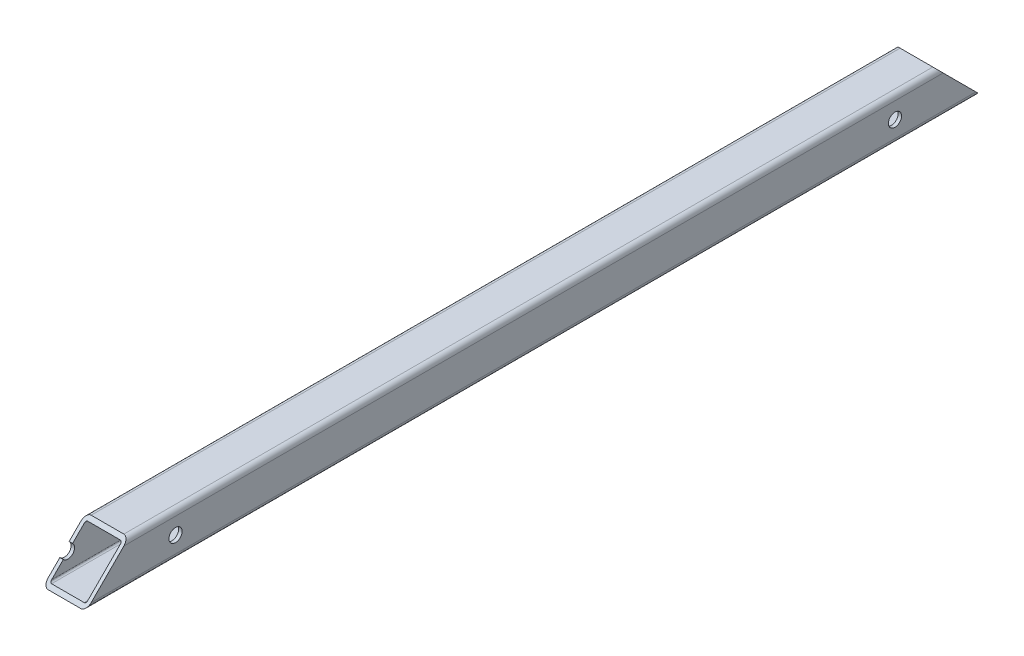
ISO-10303-21;
HEADER;
FILE_DESCRIPTION(('STEP AP214'),'2;1');
FILE_NAME('part.step','',(''),(''),'','','');
FILE_SCHEMA(('AUTOMOTIVE_DESIGN { 1 0 10303 214 1 1 1 1 }'));
ENDSEC;
DATA;
#1=APPLICATION_CONTEXT('core data for automotive mechanical design processes');
#2=APPLICATION_PROTOCOL_DEFINITION('international standard','automotive_design',2000,#1);
#3=PRODUCT_CONTEXT('',#1,'mechanical');
#4=PRODUCT('Part','Part','',(#3));
#5=PRODUCT_RELATED_PRODUCT_CATEGORY('part','',(#4));
#6=PRODUCT_DEFINITION_FORMATION('','',#4);
#7=PRODUCT_DEFINITION_CONTEXT('part definition',#1,'design');
#8=PRODUCT_DEFINITION('design','',#6,#7);
#9=PRODUCT_DEFINITION_SHAPE('','',#8);
#10=(LENGTH_UNIT() NAMED_UNIT(*) SI_UNIT(.MILLI.,.METRE.));
#11=(NAMED_UNIT(*) PLANE_ANGLE_UNIT() SI_UNIT($,.RADIAN.));
#12=(NAMED_UNIT(*) SI_UNIT($,.STERADIAN.) SOLID_ANGLE_UNIT());
#13=UNCERTAINTY_MEASURE_WITH_UNIT(LENGTH_MEASURE(1.E-05),#10,'distance_accuracy_value','');
#14=(GEOMETRIC_REPRESENTATION_CONTEXT(3) GLOBAL_UNCERTAINTY_ASSIGNED_CONTEXT((#13)) GLOBAL_UNIT_ASSIGNED_CONTEXT((#10,
#11,#12)) REPRESENTATION_CONTEXT('',''));
#15=CARTESIAN_POINT('',(0.,0.,0.));
#16=DIRECTION('',(0.,0.,1.));
#17=DIRECTION('',(1.,0.,0.));
#18=AXIS2_PLACEMENT_3D('',#15,#16,#17);
#19=CARTESIAN_POINT('',(-9.50000000001179,-9.49999999999326,-7.56017470848747E-11));
#20=DIRECTION('',(0.,0.,1.));
#21=DIRECTION('',(1.,0.,0.));
#22=AXIS2_PLACEMENT_3D('',#19,#20,#21);
#23=CYLINDRICAL_SURFACE('',#22,3.);
#24=CARTESIAN_POINT('',(-9.50000000001179,-9.49999999999326,-9.50000000007563));
#25=DIRECTION('',(0.,-0.707106781186548,0.707106781186547));
#26=DIRECTION('',(0.,0.707106781186547,0.707106781186548));
#27=AXIS2_PLACEMENT_3D('',#24,#25,#26);
#28=ELLIPSE('',#27,4.24264068711929,3.);
#29=CARTESIAN_POINT('',(-12.5000000000118,-9.49999999999331,-9.50000000007563));
#30=VERTEX_POINT('',#29);
#31=CARTESIAN_POINT('',(-9.50000000001179,-12.4999999999933,-12.5000001000755));
#32=VERTEX_POINT('',#31);
#33=EDGE_CURVE('E394',#30,#32,#28,.T.);
#34=ORIENTED_EDGE('',*,*,#33,.T.);
#35=DIRECTION('',(0.,0.,1.));
#36=VECTOR('',#35,1.);
#37=CARTESIAN_POINT('',(-9.50000000001179,-12.4999999999933,-7.56017470848747E-11));
#38=LINE('',#37,#36);
#39=CARTESIAN_POINT('',(-9.50000000001179,-12.4999999999933,507.500000099924));
#40=VERTEX_POINT('',#39);
#41=EDGE_CURVE('E11',#32,#40,#38,.T.);
#42=ORIENTED_EDGE('',*,*,#41,.T.);
#43=CARTESIAN_POINT('',(-9.50000000001179,-9.49999999999326,504.499999999925));
#44=DIRECTION('',(0.,-0.707106781186548,-0.707106781186547));
#45=DIRECTION('',(0.,0.707106781186547,-0.707106781186548));
#46=AXIS2_PLACEMENT_3D('',#43,#44,#45);
#47=ELLIPSE('',#46,4.24264068711929,3.);
#48=CARTESIAN_POINT('',(-12.5000000000118,-9.49999999999331,504.499999999925));
#49=VERTEX_POINT('',#48);
#50=EDGE_CURVE('E358',#40,#49,#47,.T.);
#51=ORIENTED_EDGE('',*,*,#50,.T.);
#52=DIRECTION('',(0.,0.,-1.));
#53=VECTOR('',#52,1.);
#54=CARTESIAN_POINT('',(-12.5000000000118,-9.49999999999331,-7.56017470848747E-11));
#55=LINE('',#54,#53);
#56=EDGE_CURVE('E295',#49,#30,#55,.T.);
#57=ORIENTED_EDGE('',*,*,#56,.T.);
#58=EDGE_LOOP('',(#34,#42,#51,#57));
#59=FACE_BOUND('',#58,.T.);
#60=ADVANCED_FACE('F16',(#59),#23,.T.);
#61=CARTESIAN_POINT('',(9.4999999999882,-12.4999999999933,-7.56017470848747E-11));
#62=DIRECTION('',(0.,-1.,0.));
#63=DIRECTION('',(0.,0.,-1.));
#64=AXIS2_PLACEMENT_3D('',#61,#62,#63);
#65=PLANE('',#64);
#66=DIRECTION('',(-1.,0.,0.));
#67=VECTOR('',#66,1.);
#68=CARTESIAN_POINT('',(4.74999999998822,-12.4999999999933,507.500000099924));
#69=LINE('',#68,#67);
#70=CARTESIAN_POINT('',(9.4999999999882,-12.4999999999933,507.500000099924));
#71=VERTEX_POINT('',#70);
#72=EDGE_CURVE('E422',#71,#40,#69,.T.);
#73=ORIENTED_EDGE('',*,*,#72,.T.);
#74=ORIENTED_EDGE('',*,*,#41,.F.);
#75=DIRECTION('',(-1.,0.,0.));
#76=VECTOR('',#75,1.);
#77=CARTESIAN_POINT('',(4.74999999998822,-12.4999999999933,-12.5000001000755));
#78=LINE('',#77,#76);
#79=CARTESIAN_POINT('',(9.4999999999882,-12.4999999999933,-12.5000001000755));
#80=VERTEX_POINT('',#79);
#81=EDGE_CURVE('E396',#80,#32,#78,.T.);
#82=ORIENTED_EDGE('',*,*,#81,.F.);
#83=DIRECTION('',(0.,0.,-1.));
#84=VECTOR('',#83,1.);
#85=CARTESIAN_POINT('',(9.4999999999882,-12.4999999999933,-7.56017470848747E-11));
#86=LINE('',#85,#84);
#87=EDGE_CURVE('E27',#71,#80,#86,.T.);
#88=ORIENTED_EDGE('',*,*,#87,.F.);
#89=EDGE_LOOP('',(#73,#74,#82,#88));
#90=FACE_BOUND('',#89,.T.);
#91=ADVANCED_FACE('F516',(#90),#65,.T.);
#92=CARTESIAN_POINT('',(9.4999999999882,-9.49999999999331,-7.56017470848747E-11));
#93=DIRECTION('',(0.,0.,1.));
#94=DIRECTION('',(0.,1.,0.));
#95=AXIS2_PLACEMENT_3D('',#92,#93,#94);
#96=CYLINDRICAL_SURFACE('',#95,3.);
#97=CARTESIAN_POINT('',(9.4999999999882,-9.49999999999331,-9.50000000007563));
#98=DIRECTION('',(0.,-0.707106781186548,0.707106781186547));
#99=DIRECTION('',(0.,0.707106781186547,0.707106781186548));
#100=AXIS2_PLACEMENT_3D('',#97,#98,#99);
#101=ELLIPSE('',#100,4.24264068711929,3.);
#102=CARTESIAN_POINT('',(12.4999999999882,-9.49999999999324,-9.50000000007563));
#103=VERTEX_POINT('',#102);
#104=EDGE_CURVE('E402',#80,#103,#101,.T.);
#105=ORIENTED_EDGE('',*,*,#104,.T.);
#106=DIRECTION('',(0.,0.,-1.));
#107=VECTOR('',#106,1.);
#108=CARTESIAN_POINT('',(12.4999999999882,-9.49999999999324,-7.56017470848747E-11));
#109=LINE('',#108,#107);
#110=CARTESIAN_POINT('',(12.4999999999882,-9.49999999999324,504.499999999925));
#111=VERTEX_POINT('',#110);
#112=EDGE_CURVE('E290',#111,#103,#109,.T.);
#113=ORIENTED_EDGE('',*,*,#112,.F.);
#114=CARTESIAN_POINT('',(9.49999999998823,-9.49999999999331,504.499999999925));
#115=DIRECTION('',(0.,-0.707106781186548,-0.707106781186547));
#116=DIRECTION('',(0.,0.707106781186547,-0.707106781186548));
#117=AXIS2_PLACEMENT_3D('',#114,#115,#116);
#118=ELLIPSE('',#117,4.24264068711929,3.);
#119=EDGE_CURVE('E444',#111,#71,#118,.T.);
#120=ORIENTED_EDGE('',*,*,#119,.T.);
#121=ORIENTED_EDGE('',*,*,#87,.T.);
#122=EDGE_LOOP('',(#105,#113,#120,#121));
#123=FACE_BOUND('',#122,.T.);
#124=ADVANCED_FACE('F521',(#123),#96,.T.);
#125=CARTESIAN_POINT('',(9.49999999998834,9.50000000000669,-7.56017470848747E-11));
#126=DIRECTION('',(0.,0.,1.));
#127=DIRECTION('',(-1.,0.,0.));
#128=AXIS2_PLACEMENT_3D('',#125,#126,#127);
#129=CYLINDRICAL_SURFACE('',#128,1.);
#130=CARTESIAN_POINT('',(9.49999999998834,9.50000000000669,9.49999999992443));
#131=DIRECTION('',(0.,0.707106781186548,-0.707106781186547));
#132=DIRECTION('',(0.,-0.707106781186547,-0.707106781186548));
#133=AXIS2_PLACEMENT_3D('',#130,#131,#132);
#134=ELLIPSE('',#133,1.4142135623731,1.);
#135=CARTESIAN_POINT('',(9.4999999999882,10.5000000000067,10.4999999999244));
#136=VERTEX_POINT('',#135);
#137=CARTESIAN_POINT('',(10.4999999999884,9.50000000000669,9.49999999992443));
#138=VERTEX_POINT('',#137);
#139=EDGE_CURVE('E254',#136,#138,#134,.T.);
#140=ORIENTED_EDGE('',*,*,#139,.T.);
#141=DIRECTION('',(0.,0.,-1.));
#142=VECTOR('',#141,1.);
#143=CARTESIAN_POINT('',(10.4999999999884,9.50000000000669,-7.56017470848747E-11));
#144=LINE('',#143,#142);
#145=CARTESIAN_POINT('',(10.4999999999884,9.50000000000662,485.499999999924));
#146=VERTEX_POINT('',#145);
#147=EDGE_CURVE('E239',#146,#138,#144,.T.);
#148=ORIENTED_EDGE('',*,*,#147,.F.);
#149=CARTESIAN_POINT('',(9.49999999998834,9.50000000000662,485.499999999924));
#150=DIRECTION('',(0.,0.707106781186548,0.707106781186547));
#151=DIRECTION('',(0.,-0.707106781186547,0.707106781186548));
#152=AXIS2_PLACEMENT_3D('',#149,#150,#151);
#153=ELLIPSE('',#152,1.4142135623731,1.);
#154=CARTESIAN_POINT('',(9.4999999999882,10.5000000000067,484.499999999924));
#155=VERTEX_POINT('',#154);
#156=EDGE_CURVE('E381',#146,#155,#153,.T.);
#157=ORIENTED_EDGE('',*,*,#156,.T.);
#158=DIRECTION('',(0.,0.,-1.));
#159=VECTOR('',#158,1.);
#160=CARTESIAN_POINT('',(9.4999999999882,10.5000000000067,-7.56017470848747E-11));
#161=LINE('',#160,#159);
#162=EDGE_CURVE('E256',#155,#136,#161,.T.);
#163=ORIENTED_EDGE('',*,*,#162,.T.);
#164=EDGE_LOOP('',(#140,#148,#157,#163));
#165=FACE_BOUND('',#164,.T.);
#166=ADVANCED_FACE('F255',(#165),#129,.F.);
#167=CARTESIAN_POINT('',(10.4999999999884,9.50000000000669,-7.56017470848747E-11));
#168=DIRECTION('',(1.,0.,0.));
#169=DIRECTION('',(0.,-1.,0.));
#170=AXIS2_PLACEMENT_3D('',#167,#168,#169);
#171=PLANE('',#170);
#172=DIRECTION('',(0.,-0.707106781186547,-0.707106781186548));
#173=VECTOR('',#172,1.);
#174=CARTESIAN_POINT('',(10.4999999999882,2.37500000000669,2.37499999992437));
#175=LINE('',#174,#173);
#176=CARTESIAN_POINT('',(10.4999999999882,-9.49999999999331,-9.50000000007563));
#177=VERTEX_POINT('',#176);
#178=EDGE_CURVE('E244',#138,#177,#175,.T.);
#179=ORIENTED_EDGE('',*,*,#178,.T.);
#180=DIRECTION('',(0.,0.,-1.));
#181=VECTOR('',#180,1.);
#182=CARTESIAN_POINT('',(10.4999999999882,-9.49999999999331,-7.56017470848747E-11));
#183=LINE('',#182,#181);
#184=CARTESIAN_POINT('',(10.4999999999882,-9.49999999999331,504.499999999925));
#185=VERTEX_POINT('',#184);
#186=EDGE_CURVE('E41',#185,#177,#183,.T.);
#187=ORIENTED_EDGE('',*,*,#186,.F.);
#188=DIRECTION('',(0.,0.707106781186547,-0.707106781186548));
#189=VECTOR('',#188,1.);
#190=CARTESIAN_POINT('',(10.4999999999882,249.875000000007,245.124999999924));
#191=LINE('',#190,#189);
#192=EDGE_CURVE('E247',#185,#146,#191,.T.);
#193=ORIENTED_EDGE('',*,*,#192,.T.);
#194=ORIENTED_EDGE('',*,*,#147,.T.);
#195=EDGE_LOOP('',(#179,#187,#193,#194));
#196=FACE_BOUND('',#195,.T.);
#197=CARTESIAN_POINT('',(10.4999999999883,6.64357457935694E-12,455.499999999959));
#198=DIRECTION('',(1.,0.,0.));
#199=DIRECTION('',(0.,1.,0.));
#200=AXIS2_PLACEMENT_3D('',#197,#198,#199);
#201=CIRCLE('',#200,3.8235);
#202=CARTESIAN_POINT('',(10.4999999999884,-3.82349999999336,455.499999999959));
#203=VERTEX_POINT('',#202);
#204=EDGE_CURVE('E367',#203,#203,#201,.T.);
#205=ORIENTED_EDGE('',*,*,#204,.T.);
#206=EDGE_LOOP('',(#205));
#207=FACE_BOUND('',#206,.T.);
#208=CARTESIAN_POINT('',(10.4999999999883,6.67910171614494E-12,37.4999999999433));
#209=DIRECTION('',(1.,0.,0.));
#210=DIRECTION('',(0.,1.,0.));
#211=AXIS2_PLACEMENT_3D('',#208,#209,#210);
#212=CIRCLE('',#211,3.8235);
#213=CARTESIAN_POINT('',(10.4999999999884,-3.82349999999333,37.4999999999433));
#214=VERTEX_POINT('',#213);
#215=EDGE_CURVE('E439',#214,#214,#212,.T.);
#216=ORIENTED_EDGE('',*,*,#215,.T.);
#217=EDGE_LOOP('',(#216));
#218=FACE_BOUND('',#217,.T.);
#219=ADVANCED_FACE('F241',(#196,#207,#218),#171,.F.);
#220=CARTESIAN_POINT('',(9.4999999999882,-9.49999999999331,-7.56017470848747E-11));
#221=DIRECTION('',(0.,0.,1.));
#222=DIRECTION('',(0.,1.,0.));
#223=AXIS2_PLACEMENT_3D('',#220,#221,#222);
#224=CYLINDRICAL_SURFACE('',#223,1.);
#225=CARTESIAN_POINT('',(9.4999999999882,-9.49999999999331,-9.50000000007563));
#226=DIRECTION('',(0.,0.707106781186548,-0.707106781186547));
#227=DIRECTION('',(0.,0.707106781186547,0.707106781186548));
#228=AXIS2_PLACEMENT_3D('',#225,#226,#227);
#229=ELLIPSE('',#228,1.4142135623731,1.);
#230=CARTESIAN_POINT('',(9.4999999999882,-10.4999999999933,-10.5000000000756));
#231=VERTEX_POINT('',#230);
#232=EDGE_CURVE('E266',#177,#231,#229,.T.);
#233=ORIENTED_EDGE('',*,*,#232,.T.);
#234=DIRECTION('',(0.,0.,-1.));
#235=VECTOR('',#234,1.);
#236=CARTESIAN_POINT('',(9.4999999999882,-10.4999999999933,-7.56017470848747E-11));
#237=LINE('',#236,#235);
#238=CARTESIAN_POINT('',(9.49999999998823,-10.4999999999933,505.499999999924));
#239=VERTEX_POINT('',#238);
#240=EDGE_CURVE('E355',#239,#231,#237,.T.);
#241=ORIENTED_EDGE('',*,*,#240,.F.);
#242=CARTESIAN_POINT('',(9.49999999998823,-9.49999999999331,504.499999999925));
#243=DIRECTION('',(0.,0.707106781186548,0.707106781186547));
#244=DIRECTION('',(0.,0.707106781186547,-0.707106781186548));
#245=AXIS2_PLACEMENT_3D('',#242,#243,#244);
#246=ELLIPSE('',#245,1.4142135623731,1.);
#247=EDGE_CURVE('E447',#239,#185,#246,.T.);
#248=ORIENTED_EDGE('',*,*,#247,.T.);
#249=ORIENTED_EDGE('',*,*,#186,.T.);
#250=EDGE_LOOP('',(#233,#241,#248,#249));
#251=FACE_BOUND('',#250,.T.);
#252=ADVANCED_FACE('F500',(#251),#224,.F.);
#253=CARTESIAN_POINT('',(-9.50000000001179,10.5000000000067,-7.56017470848747E-11));
#254=DIRECTION('',(0.,1.,0.));
#255=DIRECTION('',(1.,0.,0.));
#256=AXIS2_PLACEMENT_3D('',#253,#254,#255);
#257=PLANE('',#256);
#258=DIRECTION('',(1.,0.,0.));
#259=VECTOR('',#258,1.);
#260=CARTESIAN_POINT('',(-4.75000000001181,10.5000000000067,10.4999999999244));
#261=LINE('',#260,#259);
#262=CARTESIAN_POINT('',(-9.50000000001179,10.5000000000067,10.4999999999244));
#263=VERTEX_POINT('',#262);
#264=EDGE_CURVE('E261',#263,#136,#261,.T.);
#265=ORIENTED_EDGE('',*,*,#264,.T.);
#266=ORIENTED_EDGE('',*,*,#162,.F.);
#267=DIRECTION('',(-1.,0.,0.));
#268=VECTOR('',#267,1.);
#269=CARTESIAN_POINT('',(-4.75000000001167,10.5000000000067,484.499999999924));
#270=LINE('',#269,#268);
#271=CARTESIAN_POINT('',(-9.50000000001179,10.5000000000067,484.499999999924));
#272=VERTEX_POINT('',#271);
#273=EDGE_CURVE('E384',#155,#272,#270,.T.);
#274=ORIENTED_EDGE('',*,*,#273,.T.);
#275=DIRECTION('',(0.,0.,-1.));
#276=VECTOR('',#275,1.);
#277=CARTESIAN_POINT('',(-9.50000000001179,10.5000000000067,-7.56017470848747E-11));
#278=LINE('',#277,#276);
#279=EDGE_CURVE('E370',#272,#263,#278,.T.);
#280=ORIENTED_EDGE('',*,*,#279,.T.);
#281=EDGE_LOOP('',(#265,#266,#274,#280));
#282=FACE_BOUND('',#281,.T.);
#283=ADVANCED_FACE('F502',(#282),#257,.F.);
#284=CARTESIAN_POINT('',(-1.16529008664656E-11,247.500000000007,247.499999999924));
#285=DIRECTION('',(0.,-0.707106781186548,-0.707106781186547));
#286=DIRECTION('',(0.,0.707106781186547,-0.707106781186548));
#287=AXIS2_PLACEMENT_3D('',#284,#285,#286);
#288=PLANE('',#287);
#289=DIRECTION('',(-1.,0.,0.));
#290=VECTOR('',#289,1.);
#291=CARTESIAN_POINT('',(-17.5000000009672,-2.70362278143617,497.703622781367));
#292=LINE('',#291,#290);
#293=CARTESIAN_POINT('',(-10.5000000000117,-2.70362278143601,497.703622781367));
#294=VERTEX_POINT('',#293);
#295=CARTESIAN_POINT('',(-12.5000000000117,-2.70362278143613,497.703622781367));
#296=VERTEX_POINT('',#295);
#297=EDGE_CURVE('E284',#294,#296,#292,.T.);
#298=ORIENTED_EDGE('',*,*,#297,.T.);
#299=DIRECTION('',(0.,0.707106781186547,-0.707106781186548));
#300=VECTOR('',#299,1.);
#301=CARTESIAN_POINT('',(-12.5000000000117,245.125000000007,249.874999999924));
#302=LINE('',#301,#300);
#303=EDGE_CURVE('E299',#49,#296,#302,.T.);
#304=ORIENTED_EDGE('',*,*,#303,.F.);
#305=ORIENTED_EDGE('',*,*,#50,.F.);
#306=ORIENTED_EDGE('',*,*,#72,.F.);
#307=ORIENTED_EDGE('',*,*,#119,.F.);
#308=DIRECTION('',(0.,-0.707106781186547,0.707106781186548));
#309=VECTOR('',#308,1.);
#310=CARTESIAN_POINT('',(12.4999999999882,249.875000000007,245.124999999924));
#311=LINE('',#310,#309);
#312=CARTESIAN_POINT('',(12.4999999999883,9.50000000000667,485.499999999924));
#313=VERTEX_POINT('',#312);
#314=EDGE_CURVE('E294',#313,#111,#311,.T.);
#315=ORIENTED_EDGE('',*,*,#314,.F.);
#316=CARTESIAN_POINT('',(9.49999999998834,9.50000000000662,485.499999999924));
#317=DIRECTION('',(0.,-0.707106781186548,-0.707106781186547));
#318=DIRECTION('',(0.,-0.707106781186547,0.707106781186548));
#319=AXIS2_PLACEMENT_3D('',#316,#317,#318);
#320=ELLIPSE('',#319,4.24264068711929,3.);
#321=CARTESIAN_POINT('',(9.4999999999882,12.5000000000067,482.499999999925));
#322=VERTEX_POINT('',#321);
#323=EDGE_CURVE('E302',#322,#313,#320,.T.);
#324=ORIENTED_EDGE('',*,*,#323,.F.);
#325=DIRECTION('',(1.,0.,0.));
#326=VECTOR('',#325,1.);
#327=CARTESIAN_POINT('',(-4.75000000001174,12.5000000000067,482.499999999925));
#328=LINE('',#327,#326);
#329=CARTESIAN_POINT('',(-9.50000000001179,12.5000000000067,482.499999999925));
#330=VERTEX_POINT('',#329);
#331=EDGE_CURVE('E359',#330,#322,#328,.T.);
#332=ORIENTED_EDGE('',*,*,#331,.F.);
#333=CARTESIAN_POINT('',(-9.50000000001165,9.50000000000667,485.499999999924));
#334=DIRECTION('',(0.,-0.707106781186548,-0.707106781186547));
#335=DIRECTION('',(0.,-0.707106781186547,0.707106781186548));
#336=AXIS2_PLACEMENT_3D('',#333,#334,#335);
#337=ELLIPSE('',#336,4.24264068711929,3.);
#338=CARTESIAN_POINT('',(-12.5000000000117,9.50000000000662,485.499999999924));
#339=VERTEX_POINT('',#338);
#340=EDGE_CURVE('E139',#339,#330,#337,.T.);
#341=ORIENTED_EDGE('',*,*,#340,.F.);
#342=DIRECTION('',(0.,0.707106781186547,-0.707106781186548));
#343=VECTOR('',#342,1.);
#344=CARTESIAN_POINT('',(-12.5000000000117,245.125000000007,249.874999999924));
#345=LINE('',#344,#343);
#346=CARTESIAN_POINT('',(-12.5000000000118,2.70362277429731,492.296377225634));
#347=VERTEX_POINT('',#346);
#348=EDGE_CURVE('E330',#347,#339,#345,.T.);
#349=ORIENTED_EDGE('',*,*,#348,.F.);
#350=DIRECTION('',(1.,0.,0.));
#351=VECTOR('',#350,1.);
#352=CARTESIAN_POINT('',(-17.5000000009674,2.70362277429728,492.296377225634));
#353=LINE('',#352,#351);
#354=CARTESIAN_POINT('',(-10.5000000000118,2.70362277429744,492.296377225634));
#355=VERTEX_POINT('',#354);
#356=EDGE_CURVE('E388',#347,#355,#353,.T.);
#357=ORIENTED_EDGE('',*,*,#356,.T.);
#358=DIRECTION('',(0.,-0.707106781186547,0.707106781186548));
#359=VECTOR('',#358,1.);
#360=CARTESIAN_POINT('',(-10.5000000000117,245.125000000007,249.874999999924));
#361=LINE('',#360,#359);
#362=CARTESIAN_POINT('',(-10.5000000000117,9.50000000000667,485.499999999924));
#363=VERTEX_POINT('',#362);
#364=EDGE_CURVE('E313',#363,#355,#361,.T.);
#365=ORIENTED_EDGE('',*,*,#364,.F.);
#366=CARTESIAN_POINT('',(-9.50000000001165,9.50000000000667,485.499999999924));
#367=DIRECTION('',(0.,0.707106781186548,0.707106781186547));
#368=DIRECTION('',(0.,-0.707106781186547,0.707106781186548));
#369=AXIS2_PLACEMENT_3D('',#366,#367,#368);
#370=ELLIPSE('',#369,1.4142135623731,1.);
#371=EDGE_CURVE('E320',#272,#363,#370,.T.);
#372=ORIENTED_EDGE('',*,*,#371,.F.);
#373=ORIENTED_EDGE('',*,*,#273,.F.);
#374=ORIENTED_EDGE('',*,*,#156,.F.);
#375=ORIENTED_EDGE('',*,*,#192,.F.);
#376=ORIENTED_EDGE('',*,*,#247,.F.);
#377=DIRECTION('',(1.,0.,0.));
#378=VECTOR('',#377,1.);
#379=CARTESIAN_POINT('',(4.74999999998833,-10.4999999999934,505.499999999925));
#380=LINE('',#379,#378);
#381=CARTESIAN_POINT('',(-9.50000000001179,-10.4999999999933,505.499999999924));
#382=VERTEX_POINT('',#381);
#383=EDGE_CURVE('E351',#382,#239,#380,.T.);
#384=ORIENTED_EDGE('',*,*,#383,.F.);
#385=CARTESIAN_POINT('',(-9.50000000001179,-9.49999999999326,504.499999999925));
#386=DIRECTION('',(0.,0.707106781186548,0.707106781186547));
#387=DIRECTION('',(0.,0.707106781186547,-0.707106781186548));
#388=AXIS2_PLACEMENT_3D('',#385,#386,#387);
#389=ELLIPSE('',#388,1.4142135623731,1.);
#390=CARTESIAN_POINT('',(-10.5000000000118,-9.49999999999326,504.499999999925));
#391=VERTEX_POINT('',#390);
#392=EDGE_CURVE('E57',#391,#382,#389,.T.);
#393=ORIENTED_EDGE('',*,*,#392,.F.);
#394=DIRECTION('',(0.,-0.707106781186547,0.707106781186548));
#395=VECTOR('',#394,1.);
#396=CARTESIAN_POINT('',(-10.5000000000117,245.125000000007,249.874999999924));
#397=LINE('',#396,#395);
#398=EDGE_CURVE('E312',#294,#391,#397,.T.);
#399=ORIENTED_EDGE('',*,*,#398,.F.);
#400=EDGE_LOOP('',(#298,#304,#305,#306,#307,#315,#324,#332,#341,#349,#357,#365,#372,#373,#374,
#375,#376,#384,#393,#399));
#401=FACE_BOUND('',#400,.T.);
#402=ADVANCED_FACE('F509',(#401),#288,.F.);
#403=CARTESIAN_POINT('',(-9.50000000001165,9.50000000000674,-7.56017470848747E-11));
#404=DIRECTION('',(0.,0.,1.));
#405=DIRECTION('',(0.,-1.,0.));
#406=AXIS2_PLACEMENT_3D('',#403,#404,#405);
#407=CYLINDRICAL_SURFACE('',#406,3.);
#408=CARTESIAN_POINT('',(-9.50000000001165,9.50000000000674,9.49999999992443));
#409=DIRECTION('',(0.,-0.707106781186548,0.707106781186547));
#410=DIRECTION('',(0.,-0.707106781186547,-0.707106781186548));
#411=AXIS2_PLACEMENT_3D('',#408,#409,#410);
#412=ELLIPSE('',#411,4.24264068711929,3.);
#413=CARTESIAN_POINT('',(-9.50000000001179,12.5000000000067,12.4999999999244));
#414=VERTEX_POINT('',#413);
#415=CARTESIAN_POINT('',(-12.5000000000117,9.50000000000667,9.49999999992443));
#416=VERTEX_POINT('',#415);
#417=EDGE_CURVE('E322',#414,#416,#412,.T.);
#418=ORIENTED_EDGE('',*,*,#417,.T.);
#419=DIRECTION('',(0.,0.,-1.));
#420=VECTOR('',#419,1.);
#421=CARTESIAN_POINT('',(-12.5000000000117,9.50000000000667,-7.56017470848747E-11));
#422=LINE('',#421,#420);
#423=EDGE_CURVE('E334',#339,#416,#422,.T.);
#424=ORIENTED_EDGE('',*,*,#423,.F.);
#425=ORIENTED_EDGE('',*,*,#340,.T.);
#426=DIRECTION('',(0.,0.,-1.));
#427=VECTOR('',#426,1.);
#428=CARTESIAN_POINT('',(-9.50000000001179,12.5000000000068,-7.56017470848747E-11));
#429=LINE('',#428,#427);
#430=EDGE_CURVE('E416',#330,#414,#429,.T.);
#431=ORIENTED_EDGE('',*,*,#430,.T.);
#432=EDGE_LOOP('',(#418,#424,#425,#431));
#433=FACE_BOUND('',#432,.T.);
#434=ADVANCED_FACE('F569',(#433),#407,.T.);
#435=CARTESIAN_POINT('',(-9.50000000001179,12.5000000000068,-7.56017470848747E-11));
#436=DIRECTION('',(0.,1.,0.));
#437=DIRECTION('',(1.,0.,0.));
#438=AXIS2_PLACEMENT_3D('',#435,#436,#437);
#439=PLANE('',#438);
#440=DIRECTION('',(-1.,0.,0.));
#441=VECTOR('',#440,1.);
#442=CARTESIAN_POINT('',(-4.75000000001181,12.5000000000068,12.4999999999244));
#443=LINE('',#442,#441);
#444=CARTESIAN_POINT('',(9.4999999999882,12.5000000000067,12.4999999999244));
#445=VERTEX_POINT('',#444);
#446=EDGE_CURVE('E325',#445,#414,#443,.T.);
#447=ORIENTED_EDGE('',*,*,#446,.T.);
#448=ORIENTED_EDGE('',*,*,#430,.F.);
#449=ORIENTED_EDGE('',*,*,#331,.T.);
#450=DIRECTION('',(0.,0.,-1.));
#451=VECTOR('',#450,1.);
#452=CARTESIAN_POINT('',(9.4999999999882,12.5000000000067,-7.56017470848747E-11));
#453=LINE('',#452,#451);
#454=EDGE_CURVE('E293',#322,#445,#453,.T.);
#455=ORIENTED_EDGE('',*,*,#454,.T.);
#456=EDGE_LOOP('',(#447,#448,#449,#455));
#457=FACE_BOUND('',#456,.T.);
#458=ADVANCED_FACE('F536',(#457),#439,.T.);
#459=CARTESIAN_POINT('',(9.49999999998834,9.50000000000669,-7.56017470848747E-11));
#460=DIRECTION('',(0.,0.,1.));
#461=DIRECTION('',(-1.,0.,0.));
#462=AXIS2_PLACEMENT_3D('',#459,#460,#461);
#463=CYLINDRICAL_SURFACE('',#462,3.);
#464=CARTESIAN_POINT('',(9.49999999998834,9.50000000000669,9.49999999992443));
#465=DIRECTION('',(0.,-0.707106781186548,0.707106781186547));
#466=DIRECTION('',(0.,-0.707106781186547,-0.707106781186548));
#467=AXIS2_PLACEMENT_3D('',#464,#465,#466);
#468=ELLIPSE('',#467,4.24264068711929,3.);
#469=CARTESIAN_POINT('',(12.4999999999883,9.50000000000674,9.49999999992443));
#470=VERTEX_POINT('',#469);
#471=EDGE_CURVE('E392',#470,#445,#468,.T.);
#472=ORIENTED_EDGE('',*,*,#471,.T.);
#473=ORIENTED_EDGE('',*,*,#454,.F.);
#474=ORIENTED_EDGE('',*,*,#323,.T.);
#475=DIRECTION('',(0.,0.,-1.));
#476=VECTOR('',#475,1.);
#477=CARTESIAN_POINT('',(12.4999999999883,9.50000000000674,-7.56017470848747E-11));
#478=LINE('',#477,#476);
#479=EDGE_CURVE('E317',#313,#470,#478,.T.);
#480=ORIENTED_EDGE('',*,*,#479,.T.);
#481=EDGE_LOOP('',(#472,#473,#474,#480));
#482=FACE_BOUND('',#481,.T.);
#483=ADVANCED_FACE('F528',(#482),#463,.T.);
#484=CARTESIAN_POINT('',(12.4999999999883,9.50000000000674,-7.56017470848747E-11));
#485=DIRECTION('',(1.,0.,0.));
#486=DIRECTION('',(0.,1.,0.));
#487=AXIS2_PLACEMENT_3D('',#484,#485,#486);
#488=PLANE('',#487);
#489=DIRECTION('',(0.,0.707106781186547,0.707106781186548));
#490=VECTOR('',#489,1.);
#491=CARTESIAN_POINT('',(12.4999999999882,2.37500000000674,2.37499999992437));
#492=LINE('',#491,#490);
#493=EDGE_CURVE('E409',#103,#470,#492,.T.);
#494=ORIENTED_EDGE('',*,*,#493,.T.);
#495=ORIENTED_EDGE('',*,*,#479,.F.);
#496=ORIENTED_EDGE('',*,*,#314,.T.);
#497=ORIENTED_EDGE('',*,*,#112,.T.);
#498=EDGE_LOOP('',(#494,#495,#496,#497));
#499=FACE_BOUND('',#498,.T.);
#500=CARTESIAN_POINT('',(12.4999999999883,6.67910171614494E-12,455.499999999959));
#501=DIRECTION('',(-1.,0.,0.));
#502=DIRECTION('',(0.,1.,0.));
#503=AXIS2_PLACEMENT_3D('',#500,#501,#502);
#504=CIRCLE('',#503,3.8235);
#505=CARTESIAN_POINT('',(12.4999999999883,-3.82349999999333,455.499999999959));
#506=VERTEX_POINT('',#505);
#507=EDGE_CURVE('E307',#506,#506,#504,.T.);
#508=ORIENTED_EDGE('',*,*,#507,.T.);
#509=EDGE_LOOP('',(#508));
#510=FACE_BOUND('',#509,.T.);
#511=CARTESIAN_POINT('',(12.4999999999883,6.69686528453894E-12,37.4999999999433));
#512=DIRECTION('',(-1.,0.,0.));
#513=DIRECTION('',(0.,1.,0.));
#514=AXIS2_PLACEMENT_3D('',#511,#512,#513);
#515=CIRCLE('',#514,3.8235);
#516=CARTESIAN_POINT('',(12.4999999999883,-3.82349999999331,37.4999999999433));
#517=VERTEX_POINT('',#516);
#518=EDGE_CURVE('E283',#517,#517,#515,.T.);
#519=ORIENTED_EDGE('',*,*,#518,.T.);
#520=EDGE_LOOP('',(#519));
#521=FACE_BOUND('',#520,.T.);
#522=ADVANCED_FACE('F525',(#499,#510,#521),#488,.T.);
#523=CARTESIAN_POINT('',(-9.50000000001165,9.50000000000674,-7.56017470848747E-11));
#524=DIRECTION('',(0.,0.,1.));
#525=DIRECTION('',(0.,-1.,0.));
#526=AXIS2_PLACEMENT_3D('',#523,#524,#525);
#527=CYLINDRICAL_SURFACE('',#526,1.);
#528=CARTESIAN_POINT('',(-9.50000000001165,9.50000000000674,9.49999999992443));
#529=DIRECTION('',(0.,0.707106781186548,-0.707106781186547));
#530=DIRECTION('',(0.,-0.707106781186547,-0.707106781186548));
#531=AXIS2_PLACEMENT_3D('',#528,#529,#530);
#532=ELLIPSE('',#531,1.4142135623731,1.);
#533=CARTESIAN_POINT('',(-10.5000000000117,9.50000000000674,9.49999999992443));
#534=VERTEX_POINT('',#533);
#535=EDGE_CURVE('E326',#534,#263,#532,.T.);
#536=ORIENTED_EDGE('',*,*,#535,.T.);
#537=ORIENTED_EDGE('',*,*,#279,.F.);
#538=ORIENTED_EDGE('',*,*,#371,.T.);
#539=DIRECTION('',(0.,0.,1.));
#540=VECTOR('',#539,1.);
#541=CARTESIAN_POINT('',(-10.5000000000117,9.50000000000674,-7.56017470848747E-11));
#542=LINE('',#541,#540);
#543=EDGE_CURVE('E343',#534,#363,#542,.T.);
#544=ORIENTED_EDGE('',*,*,#543,.F.);
#545=EDGE_LOOP('',(#536,#537,#538,#544));
#546=FACE_BOUND('',#545,.T.);
#547=ADVANCED_FACE('F527',(#546),#527,.F.);
#548=CARTESIAN_POINT('',(-9.50000000001179,-9.49999999999326,-7.56017470848747E-11));
#549=DIRECTION('',(0.,0.,1.));
#550=DIRECTION('',(1.,0.,0.));
#551=AXIS2_PLACEMENT_3D('',#548,#549,#550);
#552=CYLINDRICAL_SURFACE('',#551,1.);
#553=CARTESIAN_POINT('',(-9.50000000001179,-9.49999999999326,-9.50000000007563));
#554=DIRECTION('',(0.,0.707106781186548,-0.707106781186547));
#555=DIRECTION('',(0.,0.707106781186547,0.707106781186548));
#556=AXIS2_PLACEMENT_3D('',#553,#554,#555);
#557=ELLIPSE('',#556,1.4142135623731,1.);
#558=CARTESIAN_POINT('',(-9.50000000001179,-10.4999999999933,-10.5000000000756));
#559=VERTEX_POINT('',#558);
#560=CARTESIAN_POINT('',(-10.5000000000118,-9.49999999999326,-9.50000000007563));
#561=VERTEX_POINT('',#560);
#562=EDGE_CURVE('E362',#559,#561,#557,.T.);
#563=ORIENTED_EDGE('',*,*,#562,.T.);
#564=DIRECTION('',(0.,0.,-1.));
#565=VECTOR('',#564,1.);
#566=CARTESIAN_POINT('',(-10.5000000000118,-9.49999999999326,-7.56017470848747E-11));
#567=LINE('',#566,#565);
#568=EDGE_CURVE('E335',#391,#561,#567,.T.);
#569=ORIENTED_EDGE('',*,*,#568,.F.);
#570=ORIENTED_EDGE('',*,*,#392,.T.);
#571=DIRECTION('',(0.,0.,-1.));
#572=VECTOR('',#571,1.);
#573=CARTESIAN_POINT('',(-9.50000000001179,-10.4999999999933,-7.56017470848747E-11));
#574=LINE('',#573,#572);
#575=EDGE_CURVE('E277',#382,#559,#574,.T.);
#576=ORIENTED_EDGE('',*,*,#575,.T.);
#577=EDGE_LOOP('',(#563,#569,#570,#576));
#578=FACE_BOUND('',#577,.T.);
#579=ADVANCED_FACE('F496',(#578),#552,.F.);
#580=CARTESIAN_POINT('',(9.4999999999882,-10.4999999999933,-7.56017470848747E-11));
#581=DIRECTION('',(0.,-1.,0.));
#582=DIRECTION('',(0.,0.,-1.));
#583=AXIS2_PLACEMENT_3D('',#580,#581,#582);
#584=PLANE('',#583);
#585=DIRECTION('',(-1.,0.,0.));
#586=VECTOR('',#585,1.);
#587=CARTESIAN_POINT('',(4.74999999998822,-10.4999999999933,-10.5000000000756));
#588=LINE('',#587,#586);
#589=EDGE_CURVE('E273',#231,#559,#588,.T.);
#590=ORIENTED_EDGE('',*,*,#589,.T.);
#591=ORIENTED_EDGE('',*,*,#575,.F.);
#592=ORIENTED_EDGE('',*,*,#383,.T.);
#593=ORIENTED_EDGE('',*,*,#240,.T.);
#594=EDGE_LOOP('',(#590,#591,#592,#593));
#595=FACE_BOUND('',#594,.T.);
#596=ADVANCED_FACE('F18',(#595),#584,.F.);
#597=CARTESIAN_POINT('',(-1.17950094136177E-11,6.67910171614494E-12,-7.56017470848747E-11));
#598=DIRECTION('',(0.,-0.707106781186548,0.707106781186547));
#599=DIRECTION('',(-1.,0.,0.));
#600=AXIS2_PLACEMENT_3D('',#597,#598,#599);
#601=PLANE('',#600);
#602=DIRECTION('',(1.,0.,0.));
#603=VECTOR('',#602,1.);
#604=CARTESIAN_POINT('',(-17.5000000000128,-2.70362275519581,-2.70362275527802));
#605=LINE('',#604,#603);
#606=CARTESIAN_POINT('',(-12.5000000000117,-2.70362275519586,-2.70362275527802));
#607=VERTEX_POINT('',#606);
#608=CARTESIAN_POINT('',(-10.5000000000117,-2.70362275519581,-2.70362275527802));
#609=VERTEX_POINT('',#608);
#610=EDGE_CURVE('E432',#607,#609,#605,.T.);
#611=ORIENTED_EDGE('',*,*,#610,.T.);
#612=DIRECTION('',(0.,0.707106781186547,0.707106781186548));
#613=VECTOR('',#612,1.);
#614=CARTESIAN_POINT('',(-10.5000000000117,-2.37499999999326,-2.37500000007557));
#615=LINE('',#614,#613);
#616=EDGE_CURVE('E339',#561,#609,#615,.T.);
#617=ORIENTED_EDGE('',*,*,#616,.F.);
#618=ORIENTED_EDGE('',*,*,#562,.F.);
#619=ORIENTED_EDGE('',*,*,#589,.F.);
#620=ORIENTED_EDGE('',*,*,#232,.F.);
#621=ORIENTED_EDGE('',*,*,#178,.F.);
#622=ORIENTED_EDGE('',*,*,#139,.F.);
#623=ORIENTED_EDGE('',*,*,#264,.F.);
#624=ORIENTED_EDGE('',*,*,#535,.F.);
#625=DIRECTION('',(0.,0.707106781186547,0.707106781186548));
#626=VECTOR('',#625,1.);
#627=CARTESIAN_POINT('',(-10.5000000000117,-2.37499999999326,-2.37500000007557));
#628=LINE('',#627,#626);
#629=CARTESIAN_POINT('',(-10.5000000000118,2.70362280053771,2.70362280045546));
#630=VERTEX_POINT('',#629);
#631=EDGE_CURVE('E20',#630,#534,#628,.T.);
#632=ORIENTED_EDGE('',*,*,#631,.F.);
#633=DIRECTION('',(-1.,0.,0.));
#634=VECTOR('',#633,1.);
#635=CARTESIAN_POINT('',(-17.5000000000128,2.70362280053771,2.70362280045546));
#636=LINE('',#635,#634);
#637=CARTESIAN_POINT('',(-12.5000000000118,2.70362280053766,2.70362280045546));
#638=VERTEX_POINT('',#637);
#639=EDGE_CURVE('E380',#630,#638,#636,.T.);
#640=ORIENTED_EDGE('',*,*,#639,.T.);
#641=DIRECTION('',(0.,-0.707106781186547,-0.707106781186548));
#642=VECTOR('',#641,1.);
#643=CARTESIAN_POINT('',(-12.5000000000117,-2.37499999999333,-2.37500000007557));
#644=LINE('',#643,#642);
#645=EDGE_CURVE('E350',#416,#638,#644,.T.);
#646=ORIENTED_EDGE('',*,*,#645,.F.);
#647=ORIENTED_EDGE('',*,*,#417,.F.);
#648=ORIENTED_EDGE('',*,*,#446,.F.);
#649=ORIENTED_EDGE('',*,*,#471,.F.);
#650=ORIENTED_EDGE('',*,*,#493,.F.);
#651=ORIENTED_EDGE('',*,*,#104,.F.);
#652=ORIENTED_EDGE('',*,*,#81,.T.);
#653=ORIENTED_EDGE('',*,*,#33,.F.);
#654=DIRECTION('',(0.,-0.707106781186547,-0.707106781186548));
#655=VECTOR('',#654,1.);
#656=CARTESIAN_POINT('',(-12.5000000000117,-2.37499999999333,-2.37500000007557));
#657=LINE('',#656,#655);
#658=EDGE_CURVE('E288',#607,#30,#657,.T.);
#659=ORIENTED_EDGE('',*,*,#658,.F.);
#660=EDGE_LOOP('',(#611,#617,#618,#619,#620,#621,#622,#623,#624,#632,#640,#646,#647,#648,#649,
#650,#651,#652,#653,#659));
#661=FACE_BOUND('',#660,.T.);
#662=ADVANCED_FACE('F264',(#661),#601,.F.);
#663=CARTESIAN_POINT('',(-12.5000000000118,-9.49999999999331,-7.56017470848747E-11));
#664=DIRECTION('',(-1.,0.,0.));
#665=DIRECTION('',(0.,1.,0.));
#666=AXIS2_PLACEMENT_3D('',#663,#664,#665);
#667=PLANE('',#666);
#668=CARTESIAN_POINT('',(-12.5000000000118,4.53187354310103E-08,-5.91171556152403E-11));
#669=DIRECTION('',(1.,0.,0.));
#670=DIRECTION('',(0.,1.,0.));
#671=AXIS2_PLACEMENT_3D('',#668,#669,#670);
#672=CIRCLE('',#671,3.8235);
#673=EDGE_CURVE('E376',#638,#607,#672,.T.);
#674=ORIENTED_EDGE('',*,*,#673,.T.);
#675=ORIENTED_EDGE('',*,*,#658,.T.);
#676=ORIENTED_EDGE('',*,*,#56,.F.);
#677=ORIENTED_EDGE('',*,*,#303,.T.);
#678=CARTESIAN_POINT('',(-12.5000000000122,-7.14909020871346E-09,494.999999999921));
#679=DIRECTION('',(1.,0.,0.));
#680=DIRECTION('',(0.,1.,0.));
#681=AXIS2_PLACEMENT_3D('',#678,#679,#680);
#682=CIRCLE('',#681,3.8235);
#683=EDGE_CURVE('E289',#296,#347,#682,.T.);
#684=ORIENTED_EDGE('',*,*,#683,.T.);
#685=ORIENTED_EDGE('',*,*,#348,.T.);
#686=ORIENTED_EDGE('',*,*,#423,.T.);
#687=ORIENTED_EDGE('',*,*,#645,.T.);
#688=EDGE_LOOP('',(#674,#675,#676,#677,#684,#685,#686,#687));
#689=FACE_BOUND('',#688,.T.);
#690=CARTESIAN_POINT('',(-12.5000000000118,6.66133814775094E-12,455.499999999959));
#691=DIRECTION('',(1.,0.,0.));
#692=DIRECTION('',(0.,1.,0.));
#693=AXIS2_PLACEMENT_3D('',#690,#691,#692);
#694=CIRCLE('',#693,3.8235);
#695=CARTESIAN_POINT('',(-12.5000000000118,3.82350000000667,455.499999999959));
#696=VERTEX_POINT('',#695);
#697=EDGE_CURVE('E306',#696,#696,#694,.T.);
#698=ORIENTED_EDGE('',*,*,#697,.T.);
#699=EDGE_LOOP('',(#698));
#700=FACE_BOUND('',#699,.T.);
#701=CARTESIAN_POINT('',(-12.5000000000118,6.67910171614494E-12,37.4999999999433));
#702=DIRECTION('',(1.,0.,0.));
#703=DIRECTION('',(0.,1.,0.));
#704=AXIS2_PLACEMENT_3D('',#701,#702,#703);
#705=CIRCLE('',#704,3.8235);
#706=CARTESIAN_POINT('',(-12.5000000000118,3.82350000000669,37.4999999999433));
#707=VERTEX_POINT('',#706);
#708=EDGE_CURVE('E282',#707,#707,#705,.T.);
#709=ORIENTED_EDGE('',*,*,#708,.T.);
#710=EDGE_LOOP('',(#709));
#711=FACE_BOUND('',#710,.T.);
#712=ADVANCED_FACE('F561',(#689,#700,#711),#667,.T.);
#713=CARTESIAN_POINT('',(-17.5000000009674,-7.14921455369222E-09,494.999999999921));
#714=DIRECTION('',(-1.,0.,0.));
#715=DIRECTION('',(0.,1.,0.));
#716=AXIS2_PLACEMENT_3D('',#713,#714,#715);
#717=CYLINDRICAL_SURFACE('',#716,3.8235);
#718=CARTESIAN_POINT('',(-10.5000000000122,-7.1489836273031E-09,494.999999999921));
#719=DIRECTION('',(-1.,0.,0.));
#720=DIRECTION('',(0.,1.,0.));
#721=AXIS2_PLACEMENT_3D('',#718,#719,#720);
#722=CIRCLE('',#721,3.8235);
#723=EDGE_CURVE('E308',#355,#294,#722,.T.);
#724=ORIENTED_EDGE('',*,*,#723,.F.);
#725=ORIENTED_EDGE('',*,*,#356,.F.);
#726=ORIENTED_EDGE('',*,*,#683,.F.);
#727=ORIENTED_EDGE('',*,*,#297,.F.);
#728=EDGE_LOOP('',(#724,#725,#726,#727));
#729=FACE_BOUND('',#728,.T.);
#730=ADVANCED_FACE('F585',(#729),#717,.F.);
#731=CARTESIAN_POINT('',(-10.5000000000118,-9.49999999999326,-7.56017470848747E-11));
#732=DIRECTION('',(-1.,0.,0.));
#733=DIRECTION('',(0.,0.,1.));
#734=AXIS2_PLACEMENT_3D('',#731,#732,#733);
#735=PLANE('',#734);
#736=CARTESIAN_POINT('',(-10.5000000000118,4.53187709581471E-08,-5.91171556152403E-11));
#737=DIRECTION('',(-1.,0.,0.));
#738=DIRECTION('',(0.,1.,0.));
#739=AXIS2_PLACEMENT_3D('',#736,#737,#738);
#740=CIRCLE('',#739,3.8235);
#741=EDGE_CURVE('E435',#609,#630,#740,.T.);
#742=ORIENTED_EDGE('',*,*,#741,.T.);
#743=ORIENTED_EDGE('',*,*,#631,.T.);
#744=ORIENTED_EDGE('',*,*,#543,.T.);
#745=ORIENTED_EDGE('',*,*,#364,.T.);
#746=ORIENTED_EDGE('',*,*,#723,.T.);
#747=ORIENTED_EDGE('',*,*,#398,.T.);
#748=ORIENTED_EDGE('',*,*,#568,.T.);
#749=ORIENTED_EDGE('',*,*,#616,.T.);
#750=EDGE_LOOP('',(#742,#743,#744,#745,#746,#747,#748,#749));
#751=FACE_BOUND('',#750,.T.);
#752=CARTESIAN_POINT('',(-10.5000000000118,6.66133814775094E-12,455.499999999959));
#753=DIRECTION('',(-1.,0.,0.));
#754=DIRECTION('',(0.,1.,0.));
#755=AXIS2_PLACEMENT_3D('',#752,#753,#754);
#756=CIRCLE('',#755,3.8235);
#757=CARTESIAN_POINT('',(-10.5000000000117,-3.82349999999335,455.499999999959));
#758=VERTEX_POINT('',#757);
#759=EDGE_CURVE('E303',#758,#758,#756,.T.);
#760=ORIENTED_EDGE('',*,*,#759,.T.);
#761=EDGE_LOOP('',(#760));
#762=FACE_BOUND('',#761,.T.);
#763=CARTESIAN_POINT('',(-10.5000000000118,6.67910171614494E-12,37.4999999999433));
#764=DIRECTION('',(-1.,0.,0.));
#765=DIRECTION('',(0.,1.,0.));
#766=AXIS2_PLACEMENT_3D('',#763,#764,#765);
#767=CIRCLE('',#766,3.8235);
#768=CARTESIAN_POINT('',(-10.5000000000118,-3.82349999999333,37.4999999999433));
#769=VERTEX_POINT('',#768);
#770=EDGE_CURVE('E279',#769,#769,#767,.T.);
#771=ORIENTED_EDGE('',*,*,#770,.T.);
#772=EDGE_LOOP('',(#771));
#773=FACE_BOUND('',#772,.T.);
#774=ADVANCED_FACE('F468',(#751,#762,#773),#735,.F.);
#775=CARTESIAN_POINT('',(-17.5000000000129,4.53187531945787E-08,-5.91171556152403E-11));
#776=DIRECTION('',(-1.,0.,0.));
#777=DIRECTION('',(0.,1.,0.));
#778=AXIS2_PLACEMENT_3D('',#775,#776,#777);
#779=CYLINDRICAL_SURFACE('',#778,3.8235);
#780=ORIENTED_EDGE('',*,*,#673,.F.);
#781=ORIENTED_EDGE('',*,*,#639,.F.);
#782=ORIENTED_EDGE('',*,*,#741,.F.);
#783=ORIENTED_EDGE('',*,*,#610,.F.);
#784=EDGE_LOOP('',(#780,#781,#782,#783));
#785=FACE_BOUND('',#784,.T.);
#786=ADVANCED_FACE('F477',(#785),#779,.F.);
#787=CARTESIAN_POINT('',(22.4999999999882,6.64357457935694E-12,455.499999999959));
#788=DIRECTION('',(-1.,0.,0.));
#789=DIRECTION('',(0.,1.,0.));
#790=AXIS2_PLACEMENT_3D('',#787,#788,#789);
#791=CYLINDRICAL_SURFACE('',#790,3.8235);
#792=ORIENTED_EDGE('',*,*,#697,.F.);
#793=EDGE_LOOP('',(#792));
#794=FACE_BOUND('',#793,.T.);
#795=ORIENTED_EDGE('',*,*,#759,.F.);
#796=EDGE_LOOP('',(#795));
#797=FACE_BOUND('',#796,.T.);
#798=ADVANCED_FACE('F566',(#794,#797),#791,.F.);
#799=CARTESIAN_POINT('',(22.4999999999882,6.64357457935694E-12,455.499999999959));
#800=DIRECTION('',(-1.,0.,0.));
#801=DIRECTION('',(0.,1.,0.));
#802=AXIS2_PLACEMENT_3D('',#799,#800,#801);
#803=CYLINDRICAL_SURFACE('',#802,3.8235);
#804=ORIENTED_EDGE('',*,*,#507,.F.);
#805=EDGE_LOOP('',(#804));
#806=FACE_BOUND('',#805,.T.);
#807=ORIENTED_EDGE('',*,*,#204,.F.);
#808=EDGE_LOOP('',(#807));
#809=FACE_BOUND('',#808,.T.);
#810=ADVANCED_FACE('F556',(#806,#809),#803,.F.);
#811=CARTESIAN_POINT('',(22.4999999999882,6.67910171614494E-12,37.4999999999433));
#812=DIRECTION('',(-1.,0.,0.));
#813=DIRECTION('',(0.,1.,0.));
#814=AXIS2_PLACEMENT_3D('',#811,#812,#813);
#815=CYLINDRICAL_SURFACE('',#814,3.8235);
#816=ORIENTED_EDGE('',*,*,#708,.F.);
#817=EDGE_LOOP('',(#816));
#818=FACE_BOUND('',#817,.T.);
#819=ORIENTED_EDGE('',*,*,#770,.F.);
#820=EDGE_LOOP('',(#819));
#821=FACE_BOUND('',#820,.T.);
#822=ADVANCED_FACE('F550',(#818,#821),#815,.F.);
#823=CARTESIAN_POINT('',(22.4999999999882,6.67910171614494E-12,37.4999999999433));
#824=DIRECTION('',(-1.,0.,0.));
#825=DIRECTION('',(0.,1.,0.));
#826=AXIS2_PLACEMENT_3D('',#823,#824,#825);
#827=CYLINDRICAL_SURFACE('',#826,3.8235);
#828=ORIENTED_EDGE('',*,*,#518,.F.);
#829=EDGE_LOOP('',(#828));
#830=FACE_BOUND('',#829,.T.);
#831=ORIENTED_EDGE('',*,*,#215,.F.);
#832=EDGE_LOOP('',(#831));
#833=FACE_BOUND('',#832,.T.);
#834=ADVANCED_FACE('F547',(#830,#833),#827,.F.);
#835=CLOSED_SHELL('',(#60,#91,#124,#166,#219,#252,#283,#402,#434,#458,#483,#522,#547,#579,#596,
#662,#712,#730,#774,#786,#798,#810,#822,#834));
#836=MANIFOLD_SOLID_BREP('B1',#835);
#837=ADVANCED_BREP_SHAPE_REPRESENTATION('',(#18,#836),#14);
#838=SHAPE_DEFINITION_REPRESENTATION(#9,#837);
ENDSEC;
END-ISO-10303-21;
